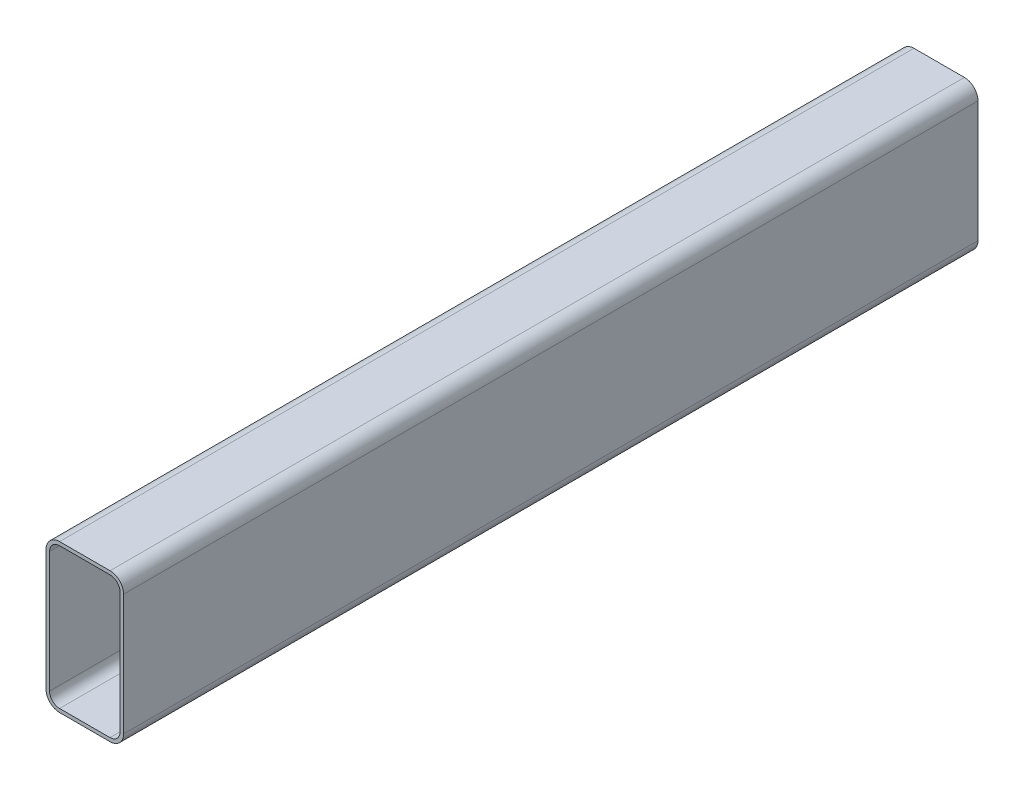
ISO-10303-21;
HEADER;
FILE_DESCRIPTION(('STEP AP214'),'2;1');
FILE_NAME('part.step','',(''),(''),'','','');
FILE_SCHEMA(('AUTOMOTIVE_DESIGN { 1 0 10303 214 1 1 1 1 }'));
ENDSEC;
DATA;
#1=APPLICATION_CONTEXT('core data for automotive mechanical design processes');
#2=APPLICATION_PROTOCOL_DEFINITION('international standard','automotive_design',2000,#1);
#3=PRODUCT_CONTEXT('',#1,'mechanical');
#4=PRODUCT('Part','Part','',(#3));
#5=PRODUCT_RELATED_PRODUCT_CATEGORY('part','',(#4));
#6=PRODUCT_DEFINITION_FORMATION('','',#4);
#7=PRODUCT_DEFINITION_CONTEXT('part definition',#1,'design');
#8=PRODUCT_DEFINITION('design','',#6,#7);
#9=PRODUCT_DEFINITION_SHAPE('','',#8);
#10=(LENGTH_UNIT() NAMED_UNIT(*) SI_UNIT(.MILLI.,.METRE.));
#11=(NAMED_UNIT(*) PLANE_ANGLE_UNIT() SI_UNIT($,.RADIAN.));
#12=(NAMED_UNIT(*) SI_UNIT($,.STERADIAN.) SOLID_ANGLE_UNIT());
#13=UNCERTAINTY_MEASURE_WITH_UNIT(LENGTH_MEASURE(1.E-05),#10,'distance_accuracy_value','');
#14=(GEOMETRIC_REPRESENTATION_CONTEXT(3) GLOBAL_UNCERTAINTY_ASSIGNED_CONTEXT((#13)) GLOBAL_UNIT_ASSIGNED_CONTEXT((#10,
#11,#12)) REPRESENTATION_CONTEXT('',''));
#15=CARTESIAN_POINT('',(0.,0.,0.));
#16=DIRECTION('',(0.,0.,1.));
#17=DIRECTION('',(1.,0.,0.));
#18=AXIS2_PLACEMENT_3D('',#15,#16,#17);
#19=CARTESIAN_POINT('',(9.001125,25.146,152.4));
#20=DIRECTION('',(0.,-1.,0.));
#21=DIRECTION('',(0.,0.,-1.));
#22=AXIS2_PLACEMENT_3D('',#19,#20,#21);
#23=PLANE('',#22);
#24=DIRECTION('',(-1.,0.,0.));
#25=VECTOR('',#24,1.);
#26=CARTESIAN_POINT('',(9.001125,25.146,-152.4));
#27=LINE('',#26,#25);
#28=CARTESIAN_POINT('',(9.001125,25.146,-152.4));
#29=VERTEX_POINT('',#28);
#30=CARTESIAN_POINT('',(-9.001125,25.146,-152.4));
#31=VERTEX_POINT('',#30);
#32=EDGE_CURVE('E197',#29,#31,#27,.T.);
#33=ORIENTED_EDGE('',*,*,#32,.F.);
#34=DIRECTION('',(0.,0.,-1.));
#35=VECTOR('',#34,1.);
#36=CARTESIAN_POINT('',(9.001125,25.146,152.4));
#37=LINE('',#36,#35);
#38=CARTESIAN_POINT('',(9.001125,25.146,152.4));
#39=VERTEX_POINT('',#38);
#40=EDGE_CURVE('E10',#39,#29,#37,.T.);
#41=ORIENTED_EDGE('',*,*,#40,.F.);
#42=DIRECTION('',(-1.,0.,0.));
#43=VECTOR('',#42,1.);
#44=CARTESIAN_POINT('',(9.001125,25.146,152.4));
#45=LINE('',#44,#43);
#46=CARTESIAN_POINT('',(-9.001125,25.146,152.4));
#47=VERTEX_POINT('',#46);
#48=EDGE_CURVE('E208',#39,#47,#45,.T.);
#49=ORIENTED_EDGE('',*,*,#48,.T.);
#50=DIRECTION('',(0.,0.,-1.));
#51=VECTOR('',#50,1.);
#52=CARTESIAN_POINT('',(-9.001125,25.146,152.4));
#53=LINE('',#52,#51);
#54=EDGE_CURVE('E241',#47,#31,#53,.T.);
#55=ORIENTED_EDGE('',*,*,#54,.T.);
#56=EDGE_LOOP('',(#33,#41,#49,#55));
#57=FACE_BOUND('',#56,.T.);
#58=ADVANCED_FACE('F16',(#57),#23,.T.);
#59=CARTESIAN_POINT('',(9.001125,21.574125,152.4));
#60=DIRECTION('',(0.,0.,-1.));
#61=DIRECTION('',(-1.,0.,0.));
#62=AXIS2_PLACEMENT_3D('',#59,#60,#61);
#63=CYLINDRICAL_SURFACE('',#62,3.571875);
#64=CARTESIAN_POINT('',(9.001125,21.574125,-152.4));
#65=DIRECTION('',(0.,0.,1.));
#66=DIRECTION('',(1.,0.,0.));
#67=AXIS2_PLACEMENT_3D('',#64,#65,#66);
#68=CIRCLE('',#67,3.571875);
#69=CARTESIAN_POINT('',(12.573,21.574125,-152.4));
#70=VERTEX_POINT('',#69);
#71=EDGE_CURVE('E201',#70,#29,#68,.T.);
#72=ORIENTED_EDGE('',*,*,#71,.F.);
#73=DIRECTION('',(0.,0.,-1.));
#74=VECTOR('',#73,1.);
#75=CARTESIAN_POINT('',(12.573,21.574125,152.4));
#76=LINE('',#75,#74);
#77=CARTESIAN_POINT('',(12.573,21.574125,152.4));
#78=VERTEX_POINT('',#77);
#79=EDGE_CURVE('E27',#78,#70,#76,.T.);
#80=ORIENTED_EDGE('',*,*,#79,.F.);
#81=CARTESIAN_POINT('',(9.001125,21.574125,152.4));
#82=DIRECTION('',(0.,0.,1.));
#83=DIRECTION('',(1.,0.,0.));
#84=AXIS2_PLACEMENT_3D('',#81,#82,#83);
#85=CIRCLE('',#84,3.571875);
#86=EDGE_CURVE('E212',#78,#39,#85,.T.);
#87=ORIENTED_EDGE('',*,*,#86,.T.);
#88=ORIENTED_EDGE('',*,*,#40,.T.);
#89=EDGE_LOOP('',(#72,#80,#87,#88));
#90=FACE_BOUND('',#89,.T.);
#91=ADVANCED_FACE('F412',(#90),#63,.F.);
#92=CARTESIAN_POINT('',(12.573,21.574125,152.4));
#93=DIRECTION('',(-1.,0.,0.));
#94=DIRECTION('',(0.,0.,1.));
#95=AXIS2_PLACEMENT_3D('',#92,#93,#94);
#96=PLANE('',#95);
#97=DIRECTION('',(0.,1.,0.));
#98=VECTOR('',#97,1.);
#99=CARTESIAN_POINT('',(12.573,21.574125,-152.4));
#100=LINE('',#99,#98);
#101=CARTESIAN_POINT('',(12.573,-21.574125,-152.4));
#102=VERTEX_POINT('',#101);
#103=EDGE_CURVE('E176',#102,#70,#100,.T.);
#104=ORIENTED_EDGE('',*,*,#103,.F.);
#105=DIRECTION('',(0.,0.,-1.));
#106=VECTOR('',#105,1.);
#107=CARTESIAN_POINT('',(12.573,-21.574125,152.4));
#108=LINE('',#107,#106);
#109=CARTESIAN_POINT('',(12.573,-21.574125,152.4));
#110=VERTEX_POINT('',#109);
#111=EDGE_CURVE('E141',#110,#102,#108,.T.);
#112=ORIENTED_EDGE('',*,*,#111,.F.);
#113=DIRECTION('',(0.,1.,0.));
#114=VECTOR('',#113,1.);
#115=CARTESIAN_POINT('',(12.573,21.574125,152.4));
#116=LINE('',#115,#114);
#117=EDGE_CURVE('E280',#110,#78,#116,.T.);
#118=ORIENTED_EDGE('',*,*,#117,.T.);
#119=ORIENTED_EDGE('',*,*,#79,.T.);
#120=EDGE_LOOP('',(#104,#112,#118,#119));
#121=FACE_BOUND('',#120,.T.);
#122=ADVANCED_FACE('F418',(#121),#96,.T.);
#123=CARTESIAN_POINT('',(9.001125,-21.574125,152.4));
#124=DIRECTION('',(0.,0.,-1.));
#125=DIRECTION('',(-1.,0.,0.));
#126=AXIS2_PLACEMENT_3D('',#123,#124,#125);
#127=CYLINDRICAL_SURFACE('',#126,3.571875);
#128=CARTESIAN_POINT('',(9.001125,-21.574125,-152.4));
#129=DIRECTION('',(0.,0.,1.));
#130=DIRECTION('',(1.,0.,0.));
#131=AXIS2_PLACEMENT_3D('',#128,#129,#130);
#132=CIRCLE('',#131,3.571875);
#133=CARTESIAN_POINT('',(9.001125,-25.146,-152.4));
#134=VERTEX_POINT('',#133);
#135=EDGE_CURVE('E171',#134,#102,#132,.T.);
#136=ORIENTED_EDGE('',*,*,#135,.F.);
#137=DIRECTION('',(0.,0.,-1.));
#138=VECTOR('',#137,1.);
#139=CARTESIAN_POINT('',(9.001125,-25.146,152.4));
#140=LINE('',#139,#138);
#141=CARTESIAN_POINT('',(9.001125,-25.146,152.4));
#142=VERTEX_POINT('',#141);
#143=EDGE_CURVE('E125',#142,#134,#140,.T.);
#144=ORIENTED_EDGE('',*,*,#143,.F.);
#145=CARTESIAN_POINT('',(9.001125,-21.574125,152.4));
#146=DIRECTION('',(0.,0.,1.));
#147=DIRECTION('',(1.,0.,0.));
#148=AXIS2_PLACEMENT_3D('',#145,#146,#147);
#149=CIRCLE('',#148,3.571875);
#150=EDGE_CURVE('E276',#142,#110,#149,.T.);
#151=ORIENTED_EDGE('',*,*,#150,.T.);
#152=ORIENTED_EDGE('',*,*,#111,.T.);
#153=EDGE_LOOP('',(#136,#144,#151,#152));
#154=FACE_BOUND('',#153,.T.);
#155=ADVANCED_FACE('F172',(#154),#127,.F.);
#156=CARTESIAN_POINT('',(-9.001125,-25.146,152.4));
#157=DIRECTION('',(0.,1.,0.));
#158=DIRECTION('',(1.,0.,0.));
#159=AXIS2_PLACEMENT_3D('',#156,#157,#158);
#160=PLANE('',#159);
#161=DIRECTION('',(1.,0.,0.));
#162=VECTOR('',#161,1.);
#163=CARTESIAN_POINT('',(-9.001125,-25.146,-152.4));
#164=LINE('',#163,#162);
#165=CARTESIAN_POINT('',(-9.001125,-25.146,-152.4));
#166=VERTEX_POINT('',#165);
#167=EDGE_CURVE('E162',#166,#134,#164,.T.);
#168=ORIENTED_EDGE('',*,*,#167,.F.);
#169=DIRECTION('',(0.,0.,-1.));
#170=VECTOR('',#169,1.);
#171=CARTESIAN_POINT('',(-9.001125,-25.146,152.4));
#172=LINE('',#171,#170);
#173=CARTESIAN_POINT('',(-9.001125,-25.146,152.4));
#174=VERTEX_POINT('',#173);
#175=EDGE_CURVE('E168',#174,#166,#172,.T.);
#176=ORIENTED_EDGE('',*,*,#175,.F.);
#177=DIRECTION('',(1.,0.,0.));
#178=VECTOR('',#177,1.);
#179=CARTESIAN_POINT('',(-9.001125,-25.146,152.4));
#180=LINE('',#179,#178);
#181=EDGE_CURVE('E165',#174,#142,#180,.T.);
#182=ORIENTED_EDGE('',*,*,#181,.T.);
#183=ORIENTED_EDGE('',*,*,#143,.T.);
#184=EDGE_LOOP('',(#168,#176,#182,#183));
#185=FACE_BOUND('',#184,.T.);
#186=ADVANCED_FACE('F160',(#185),#160,.T.);
#187=CARTESIAN_POINT('',(-9.001125,-21.574125,152.4));
#188=DIRECTION('',(0.,0.,-1.));
#189=DIRECTION('',(-1.,0.,0.));
#190=AXIS2_PLACEMENT_3D('',#187,#188,#189);
#191=CYLINDRICAL_SURFACE('',#190,3.571875);
#192=CARTESIAN_POINT('',(-9.001125,-21.574125,-152.4));
#193=DIRECTION('',(0.,0.,1.));
#194=DIRECTION('',(1.,0.,0.));
#195=AXIS2_PLACEMENT_3D('',#192,#193,#194);
#196=CIRCLE('',#195,3.571875);
#197=CARTESIAN_POINT('',(-12.573,-21.574125,-152.4));
#198=VERTEX_POINT('',#197);
#199=EDGE_CURVE('E183',#198,#166,#196,.T.);
#200=ORIENTED_EDGE('',*,*,#199,.F.);
#201=DIRECTION('',(0.,0.,-1.));
#202=VECTOR('',#201,1.);
#203=CARTESIAN_POINT('',(-12.573,-21.574125,152.4));
#204=LINE('',#203,#202);
#205=CARTESIAN_POINT('',(-12.573,-21.574125,152.4));
#206=VERTEX_POINT('',#205);
#207=EDGE_CURVE('E291',#206,#198,#204,.T.);
#208=ORIENTED_EDGE('',*,*,#207,.F.);
#209=CARTESIAN_POINT('',(-9.001125,-21.574125,152.4));
#210=DIRECTION('',(0.,0.,1.));
#211=DIRECTION('',(1.,0.,0.));
#212=AXIS2_PLACEMENT_3D('',#209,#210,#211);
#213=CIRCLE('',#212,3.571875);
#214=EDGE_CURVE('E256',#206,#174,#213,.T.);
#215=ORIENTED_EDGE('',*,*,#214,.T.);
#216=ORIENTED_EDGE('',*,*,#175,.T.);
#217=EDGE_LOOP('',(#200,#208,#215,#216));
#218=FACE_BOUND('',#217,.T.);
#219=ADVANCED_FACE('F399',(#218),#191,.F.);
#220=CARTESIAN_POINT('',(-12.573,-21.574125,152.4));
#221=DIRECTION('',(1.,0.,0.));
#222=DIRECTION('',(0.,1.,0.));
#223=AXIS2_PLACEMENT_3D('',#220,#221,#222);
#224=PLANE('',#223);
#225=DIRECTION('',(0.,-1.,0.));
#226=VECTOR('',#225,1.);
#227=CARTESIAN_POINT('',(-12.573,-21.574125,-152.4));
#228=LINE('',#227,#226);
#229=CARTESIAN_POINT('',(-12.573,21.574125,-152.4));
#230=VERTEX_POINT('',#229);
#231=EDGE_CURVE('E191',#230,#198,#228,.T.);
#232=ORIENTED_EDGE('',*,*,#231,.F.);
#233=DIRECTION('',(0.,0.,-1.));
#234=VECTOR('',#233,1.);
#235=CARTESIAN_POINT('',(-12.573,21.574125,152.4));
#236=LINE('',#235,#234);
#237=CARTESIAN_POINT('',(-12.573,21.574125,152.4));
#238=VERTEX_POINT('',#237);
#239=EDGE_CURVE('E244',#238,#230,#236,.T.);
#240=ORIENTED_EDGE('',*,*,#239,.F.);
#241=DIRECTION('',(0.,-1.,0.));
#242=VECTOR('',#241,1.);
#243=CARTESIAN_POINT('',(-12.573,-21.574125,152.4));
#244=LINE('',#243,#242);
#245=EDGE_CURVE('E206',#238,#206,#244,.T.);
#246=ORIENTED_EDGE('',*,*,#245,.T.);
#247=ORIENTED_EDGE('',*,*,#207,.T.);
#248=EDGE_LOOP('',(#232,#240,#246,#247));
#249=FACE_BOUND('',#248,.T.);
#250=ADVANCED_FACE('F397',(#249),#224,.T.);
#251=CARTESIAN_POINT('',(-9.001125,21.574125,152.4));
#252=DIRECTION('',(0.,0.,-1.));
#253=DIRECTION('',(-1.,0.,0.));
#254=AXIS2_PLACEMENT_3D('',#251,#252,#253);
#255=CYLINDRICAL_SURFACE('',#254,3.571875);
#256=CARTESIAN_POINT('',(-9.001125,21.574125,-152.4));
#257=DIRECTION('',(0.,0.,1.));
#258=DIRECTION('',(1.,0.,0.));
#259=AXIS2_PLACEMENT_3D('',#256,#257,#258);
#260=CIRCLE('',#259,3.571875);
#261=EDGE_CURVE('E218',#31,#230,#260,.T.);
#262=ORIENTED_EDGE('',*,*,#261,.F.);
#263=ORIENTED_EDGE('',*,*,#54,.F.);
#264=CARTESIAN_POINT('',(-9.001125,21.574125,152.4));
#265=DIRECTION('',(0.,0.,1.));
#266=DIRECTION('',(1.,0.,0.));
#267=AXIS2_PLACEMENT_3D('',#264,#265,#266);
#268=CIRCLE('',#267,3.571875);
#269=EDGE_CURVE('E213',#47,#238,#268,.T.);
#270=ORIENTED_EDGE('',*,*,#269,.T.);
#271=ORIENTED_EDGE('',*,*,#239,.T.);
#272=EDGE_LOOP('',(#262,#263,#270,#271));
#273=FACE_BOUND('',#272,.T.);
#274=ADVANCED_FACE('F18',(#273),#255,.F.);
#275=CARTESIAN_POINT('',(13.843,21.574125,152.4));
#276=DIRECTION('',(-1.,0.,0.));
#277=DIRECTION('',(0.,0.,1.));
#278=AXIS2_PLACEMENT_3D('',#275,#276,#277);
#279=PLANE('',#278);
#280=DIRECTION('',(0.,1.,0.));
#281=VECTOR('',#280,1.);
#282=CARTESIAN_POINT('',(13.843,21.574125,-152.4));
#283=LINE('',#282,#281);
#284=CARTESIAN_POINT('',(13.843,-21.574125,-152.4));
#285=VERTEX_POINT('',#284);
#286=CARTESIAN_POINT('',(13.843,21.574125,-152.4));
#287=VERTEX_POINT('',#286);
#288=EDGE_CURVE('E252',#285,#287,#283,.T.);
#289=ORIENTED_EDGE('',*,*,#288,.T.);
#290=DIRECTION('',(0.,0.,-1.));
#291=VECTOR('',#290,1.);
#292=CARTESIAN_POINT('',(13.843,21.574125,152.4));
#293=LINE('',#292,#291);
#294=CARTESIAN_POINT('',(13.843,21.574125,152.4));
#295=VERTEX_POINT('',#294);
#296=EDGE_CURVE('E236',#295,#287,#293,.T.);
#297=ORIENTED_EDGE('',*,*,#296,.F.);
#298=DIRECTION('',(0.,1.,0.));
#299=VECTOR('',#298,1.);
#300=CARTESIAN_POINT('',(13.843,21.574125,152.4));
#301=LINE('',#300,#299);
#302=CARTESIAN_POINT('',(13.843,-21.574125,152.4));
#303=VERTEX_POINT('',#302);
#304=EDGE_CURVE('E202',#303,#295,#301,.T.);
#305=ORIENTED_EDGE('',*,*,#304,.F.);
#306=DIRECTION('',(0.,0.,-1.));
#307=VECTOR('',#306,1.);
#308=CARTESIAN_POINT('',(13.843,-21.574125,152.4));
#309=LINE('',#308,#307);
#310=EDGE_CURVE('E195',#303,#285,#309,.T.);
#311=ORIENTED_EDGE('',*,*,#310,.T.);
#312=EDGE_LOOP('',(#289,#297,#305,#311));
#313=FACE_BOUND('',#312,.T.);
#314=ADVANCED_FACE('F433',(#313),#279,.F.);
#315=CARTESIAN_POINT('',(9.001125,-21.574125,152.4));
#316=DIRECTION('',(0.,0.,-1.));
#317=DIRECTION('',(-1.,0.,0.));
#318=AXIS2_PLACEMENT_3D('',#315,#316,#317);
#319=CYLINDRICAL_SURFACE('',#318,4.841875);
#320=CARTESIAN_POINT('',(9.001125,-21.574125,-152.4));
#321=DIRECTION('',(0.,0.,1.));
#322=DIRECTION('',(1.,0.,0.));
#323=AXIS2_PLACEMENT_3D('',#320,#321,#322);
#324=CIRCLE('',#323,4.841875);
#325=CARTESIAN_POINT('',(9.001125,-26.416,-152.4));
#326=VERTEX_POINT('',#325);
#327=EDGE_CURVE('E248',#326,#285,#324,.T.);
#328=ORIENTED_EDGE('',*,*,#327,.T.);
#329=ORIENTED_EDGE('',*,*,#310,.F.);
#330=CARTESIAN_POINT('',(9.001125,-21.574125,152.4));
#331=DIRECTION('',(0.,0.,1.));
#332=DIRECTION('',(1.,0.,0.));
#333=AXIS2_PLACEMENT_3D('',#330,#331,#332);
#334=CIRCLE('',#333,4.841875);
#335=CARTESIAN_POINT('',(9.001125,-26.416,152.4));
#336=VERTEX_POINT('',#335);
#337=EDGE_CURVE('E207',#336,#303,#334,.T.);
#338=ORIENTED_EDGE('',*,*,#337,.F.);
#339=DIRECTION('',(0.,0.,-1.));
#340=VECTOR('',#339,1.);
#341=CARTESIAN_POINT('',(9.001125,-26.416,152.4));
#342=LINE('',#341,#340);
#343=EDGE_CURVE('E237',#336,#326,#342,.T.);
#344=ORIENTED_EDGE('',*,*,#343,.T.);
#345=EDGE_LOOP('',(#328,#329,#338,#344));
#346=FACE_BOUND('',#345,.T.);
#347=ADVANCED_FACE('F342',(#346),#319,.T.);
#348=CARTESIAN_POINT('',(-9.001125,-26.416,152.4));
#349=DIRECTION('',(0.,1.,0.));
#350=DIRECTION('',(1.,0.,0.));
#351=AXIS2_PLACEMENT_3D('',#348,#349,#350);
#352=PLANE('',#351);
#353=DIRECTION('',(1.,0.,0.));
#354=VECTOR('',#353,1.);
#355=CARTESIAN_POINT('',(-9.001125,-26.416,-152.4));
#356=LINE('',#355,#354);
#357=CARTESIAN_POINT('',(-9.001125,-26.416,-152.4));
#358=VERTEX_POINT('',#357);
#359=EDGE_CURVE('E251',#358,#326,#356,.T.);
#360=ORIENTED_EDGE('',*,*,#359,.T.);
#361=ORIENTED_EDGE('',*,*,#343,.F.);
#362=DIRECTION('',(1.,0.,0.));
#363=VECTOR('',#362,1.);
#364=CARTESIAN_POINT('',(-9.001125,-26.416,152.4));
#365=LINE('',#364,#363);
#366=CARTESIAN_POINT('',(-9.001125,-26.416,152.4));
#367=VERTEX_POINT('',#366);
#368=EDGE_CURVE('E309',#367,#336,#365,.T.);
#369=ORIENTED_EDGE('',*,*,#368,.F.);
#370=DIRECTION('',(0.,0.,-1.));
#371=VECTOR('',#370,1.);
#372=CARTESIAN_POINT('',(-9.001125,-26.416,152.4));
#373=LINE('',#372,#371);
#374=EDGE_CURVE('E231',#367,#358,#373,.T.);
#375=ORIENTED_EDGE('',*,*,#374,.T.);
#376=EDGE_LOOP('',(#360,#361,#369,#375));
#377=FACE_BOUND('',#376,.T.);
#378=ADVANCED_FACE('F328',(#377),#352,.F.);
#379=CARTESIAN_POINT('',(-9.001125,-21.574125,152.4));
#380=DIRECTION('',(0.,0.,-1.));
#381=DIRECTION('',(-1.,0.,0.));
#382=AXIS2_PLACEMENT_3D('',#379,#380,#381);
#383=CYLINDRICAL_SURFACE('',#382,4.841875);
#384=CARTESIAN_POINT('',(-9.001125,-21.574125,-152.4));
#385=DIRECTION('',(0.,0.,1.));
#386=DIRECTION('',(1.,0.,0.));
#387=AXIS2_PLACEMENT_3D('',#384,#385,#386);
#388=CIRCLE('',#387,4.841875);
#389=CARTESIAN_POINT('',(-13.843,-21.574125,-152.4));
#390=VERTEX_POINT('',#389);
#391=EDGE_CURVE('E284',#390,#358,#388,.T.);
#392=ORIENTED_EDGE('',*,*,#391,.T.);
#393=ORIENTED_EDGE('',*,*,#374,.F.);
#394=CARTESIAN_POINT('',(-9.001125,-21.574125,152.4));
#395=DIRECTION('',(0.,0.,1.));
#396=DIRECTION('',(1.,0.,0.));
#397=AXIS2_PLACEMENT_3D('',#394,#395,#396);
#398=CIRCLE('',#397,4.841875);
#399=CARTESIAN_POINT('',(-13.843,-21.574125,152.4));
#400=VERTEX_POINT('',#399);
#401=EDGE_CURVE('E226',#400,#367,#398,.T.);
#402=ORIENTED_EDGE('',*,*,#401,.F.);
#403=DIRECTION('',(0.,0.,-1.));
#404=VECTOR('',#403,1.);
#405=CARTESIAN_POINT('',(-13.843,-21.574125,152.4));
#406=LINE('',#405,#404);
#407=EDGE_CURVE('E228',#400,#390,#406,.T.);
#408=ORIENTED_EDGE('',*,*,#407,.T.);
#409=EDGE_LOOP('',(#392,#393,#402,#408));
#410=FACE_BOUND('',#409,.T.);
#411=ADVANCED_FACE('F336',(#410),#383,.T.);
#412=CARTESIAN_POINT('',(-13.843,-21.574125,152.4));
#413=DIRECTION('',(1.,0.,0.));
#414=DIRECTION('',(0.,1.,0.));
#415=AXIS2_PLACEMENT_3D('',#412,#413,#414);
#416=PLANE('',#415);
#417=DIRECTION('',(0.,-1.,0.));
#418=VECTOR('',#417,1.);
#419=CARTESIAN_POINT('',(-13.843,-21.574125,-152.4));
#420=LINE('',#419,#418);
#421=CARTESIAN_POINT('',(-13.843,21.574125,-152.4));
#422=VERTEX_POINT('',#421);
#423=EDGE_CURVE('E281',#422,#390,#420,.T.);
#424=ORIENTED_EDGE('',*,*,#423,.T.);
#425=ORIENTED_EDGE('',*,*,#407,.F.);
#426=DIRECTION('',(0.,-1.,0.));
#427=VECTOR('',#426,1.);
#428=CARTESIAN_POINT('',(-13.843,-21.574125,152.4));
#429=LINE('',#428,#427);
#430=CARTESIAN_POINT('',(-13.843,21.574125,152.4));
#431=VERTEX_POINT('',#430);
#432=EDGE_CURVE('E222',#431,#400,#429,.T.);
#433=ORIENTED_EDGE('',*,*,#432,.F.);
#434=DIRECTION('',(0.,0.,-1.));
#435=VECTOR('',#434,1.);
#436=CARTESIAN_POINT('',(-13.843,21.574125,152.4));
#437=LINE('',#436,#435);
#438=EDGE_CURVE('E232',#431,#422,#437,.T.);
#439=ORIENTED_EDGE('',*,*,#438,.T.);
#440=EDGE_LOOP('',(#424,#425,#433,#439));
#441=FACE_BOUND('',#440,.T.);
#442=ADVANCED_FACE('F426',(#441),#416,.F.);
#443=CARTESIAN_POINT('',(-9.001125,21.574125,152.4));
#444=DIRECTION('',(0.,0.,-1.));
#445=DIRECTION('',(-1.,0.,0.));
#446=AXIS2_PLACEMENT_3D('',#443,#444,#445);
#447=CYLINDRICAL_SURFACE('',#446,4.841875);
#448=CARTESIAN_POINT('',(-9.001125,21.574125,-152.4));
#449=DIRECTION('',(0.,0.,1.));
#450=DIRECTION('',(1.,0.,0.));
#451=AXIS2_PLACEMENT_3D('',#448,#449,#450);
#452=CIRCLE('',#451,4.841875);
#453=CARTESIAN_POINT('',(-9.001125,26.416,-152.4));
#454=VERTEX_POINT('',#453);
#455=EDGE_CURVE('E219',#454,#422,#452,.T.);
#456=ORIENTED_EDGE('',*,*,#455,.T.);
#457=ORIENTED_EDGE('',*,*,#438,.F.);
#458=CARTESIAN_POINT('',(-9.001125,21.574125,152.4));
#459=DIRECTION('',(0.,0.,1.));
#460=DIRECTION('',(1.,0.,0.));
#461=AXIS2_PLACEMENT_3D('',#458,#459,#460);
#462=CIRCLE('',#461,4.841875);
#463=CARTESIAN_POINT('',(-9.001125,26.416,152.4));
#464=VERTEX_POINT('',#463);
#465=EDGE_CURVE('E227',#464,#431,#462,.T.);
#466=ORIENTED_EDGE('',*,*,#465,.F.);
#467=DIRECTION('',(0.,0.,-1.));
#468=VECTOR('',#467,1.);
#469=CARTESIAN_POINT('',(-9.001125,26.416,152.4));
#470=LINE('',#469,#468);
#471=EDGE_CURVE('E305',#464,#454,#470,.T.);
#472=ORIENTED_EDGE('',*,*,#471,.T.);
#473=EDGE_LOOP('',(#456,#457,#466,#472));
#474=FACE_BOUND('',#473,.T.);
#475=ADVANCED_FACE('F423',(#474),#447,.T.);
#476=CARTESIAN_POINT('',(9.001125,26.416,152.4));
#477=DIRECTION('',(0.,-1.,0.));
#478=DIRECTION('',(0.,0.,-1.));
#479=AXIS2_PLACEMENT_3D('',#476,#477,#478);
#480=PLANE('',#479);
#481=DIRECTION('',(-1.,0.,0.));
#482=VECTOR('',#481,1.);
#483=CARTESIAN_POINT('',(9.001125,26.416,-152.4));
#484=LINE('',#483,#482);
#485=CARTESIAN_POINT('',(9.001125,26.416,-152.4));
#486=VERTEX_POINT('',#485);
#487=EDGE_CURVE('E214',#486,#454,#484,.T.);
#488=ORIENTED_EDGE('',*,*,#487,.T.);
#489=ORIENTED_EDGE('',*,*,#471,.F.);
#490=DIRECTION('',(-1.,0.,0.));
#491=VECTOR('',#490,1.);
#492=CARTESIAN_POINT('',(9.001125,26.416,152.4));
#493=LINE('',#492,#491);
#494=CARTESIAN_POINT('',(9.001125,26.416,152.4));
#495=VERTEX_POINT('',#494);
#496=EDGE_CURVE('E20',#495,#464,#493,.T.);
#497=ORIENTED_EDGE('',*,*,#496,.F.);
#498=DIRECTION('',(0.,0.,-1.));
#499=VECTOR('',#498,1.);
#500=CARTESIAN_POINT('',(9.001125,26.416,152.4));
#501=LINE('',#500,#499);
#502=EDGE_CURVE('E200',#495,#486,#501,.T.);
#503=ORIENTED_EDGE('',*,*,#502,.T.);
#504=EDGE_LOOP('',(#488,#489,#497,#503));
#505=FACE_BOUND('',#504,.T.);
#506=ADVANCED_FACE('F372',(#505),#480,.F.);
#507=CARTESIAN_POINT('',(9.001125,21.574125,152.4));
#508=DIRECTION('',(0.,0.,-1.));
#509=DIRECTION('',(-1.,0.,0.));
#510=AXIS2_PLACEMENT_3D('',#507,#508,#509);
#511=CYLINDRICAL_SURFACE('',#510,4.841875);
#512=CARTESIAN_POINT('',(9.001125,21.574125,-152.4));
#513=DIRECTION('',(0.,0.,1.));
#514=DIRECTION('',(1.,0.,0.));
#515=AXIS2_PLACEMENT_3D('',#512,#513,#514);
#516=CIRCLE('',#515,4.841875);
#517=EDGE_CURVE('E253',#287,#486,#516,.T.);
#518=ORIENTED_EDGE('',*,*,#517,.T.);
#519=ORIENTED_EDGE('',*,*,#502,.F.);
#520=CARTESIAN_POINT('',(9.001125,21.574125,152.4));
#521=DIRECTION('',(0.,0.,1.));
#522=DIRECTION('',(1.,0.,0.));
#523=AXIS2_PLACEMENT_3D('',#520,#521,#522);
#524=CIRCLE('',#523,4.841875);
#525=EDGE_CURVE('E369',#295,#495,#524,.T.);
#526=ORIENTED_EDGE('',*,*,#525,.F.);
#527=ORIENTED_EDGE('',*,*,#296,.T.);
#528=EDGE_LOOP('',(#518,#519,#526,#527));
#529=FACE_BOUND('',#528,.T.);
#530=ADVANCED_FACE('F367',(#529),#511,.T.);
#531=CARTESIAN_POINT('',(9.001125,21.574125,-152.4));
#532=DIRECTION('',(0.,0.,1.));
#533=DIRECTION('',(1.,0.,0.));
#534=AXIS2_PLACEMENT_3D('',#531,#532,#533);
#535=PLANE('',#534);
#536=ORIENTED_EDGE('',*,*,#261,.T.);
#537=ORIENTED_EDGE('',*,*,#231,.T.);
#538=ORIENTED_EDGE('',*,*,#199,.T.);
#539=ORIENTED_EDGE('',*,*,#167,.T.);
#540=ORIENTED_EDGE('',*,*,#135,.T.);
#541=ORIENTED_EDGE('',*,*,#103,.T.);
#542=ORIENTED_EDGE('',*,*,#71,.T.);
#543=ORIENTED_EDGE('',*,*,#32,.T.);
#544=EDGE_LOOP('',(#536,#537,#538,#539,#540,#541,#542,#543));
#545=FACE_BOUND('',#544,.T.);
#546=ORIENTED_EDGE('',*,*,#517,.F.);
#547=ORIENTED_EDGE('',*,*,#288,.F.);
#548=ORIENTED_EDGE('',*,*,#327,.F.);
#549=ORIENTED_EDGE('',*,*,#359,.F.);
#550=ORIENTED_EDGE('',*,*,#391,.F.);
#551=ORIENTED_EDGE('',*,*,#423,.F.);
#552=ORIENTED_EDGE('',*,*,#455,.F.);
#553=ORIENTED_EDGE('',*,*,#487,.F.);
#554=EDGE_LOOP('',(#546,#547,#548,#549,#550,#551,#552,#553));
#555=FACE_BOUND('',#554,.T.);
#556=ADVANCED_FACE('F179',(#545,#555),#535,.F.);
#557=CARTESIAN_POINT('',(9.001125,21.574125,152.4));
#558=DIRECTION('',(0.,0.,1.));
#559=DIRECTION('',(1.,0.,0.));
#560=AXIS2_PLACEMENT_3D('',#557,#558,#559);
#561=PLANE('',#560);
#562=ORIENTED_EDGE('',*,*,#245,.F.);
#563=ORIENTED_EDGE('',*,*,#269,.F.);
#564=ORIENTED_EDGE('',*,*,#48,.F.);
#565=ORIENTED_EDGE('',*,*,#86,.F.);
#566=ORIENTED_EDGE('',*,*,#117,.F.);
#567=ORIENTED_EDGE('',*,*,#150,.F.);
#568=ORIENTED_EDGE('',*,*,#181,.F.);
#569=ORIENTED_EDGE('',*,*,#214,.F.);
#570=EDGE_LOOP('',(#562,#563,#564,#565,#566,#567,#568,#569));
#571=FACE_BOUND('',#570,.T.);
#572=ORIENTED_EDGE('',*,*,#525,.T.);
#573=ORIENTED_EDGE('',*,*,#496,.T.);
#574=ORIENTED_EDGE('',*,*,#465,.T.);
#575=ORIENTED_EDGE('',*,*,#432,.T.);
#576=ORIENTED_EDGE('',*,*,#401,.T.);
#577=ORIENTED_EDGE('',*,*,#368,.T.);
#578=ORIENTED_EDGE('',*,*,#337,.T.);
#579=ORIENTED_EDGE('',*,*,#304,.T.);
#580=EDGE_LOOP('',(#572,#573,#574,#575,#576,#577,#578,#579));
#581=FACE_BOUND('',#580,.T.);
#582=ADVANCED_FACE('F375',(#571,#581),#561,.T.);
#583=CLOSED_SHELL('',(#58,#91,#122,#155,#186,#219,#250,#274,#314,#347,#378,#411,#442,#475,#506,
#530,#556,#582));
#584=MANIFOLD_SOLID_BREP('B1',#583);
#585=ADVANCED_BREP_SHAPE_REPRESENTATION('',(#18,#584),#14);
#586=SHAPE_DEFINITION_REPRESENTATION(#9,#585);
ENDSEC;
END-ISO-10303-21;
